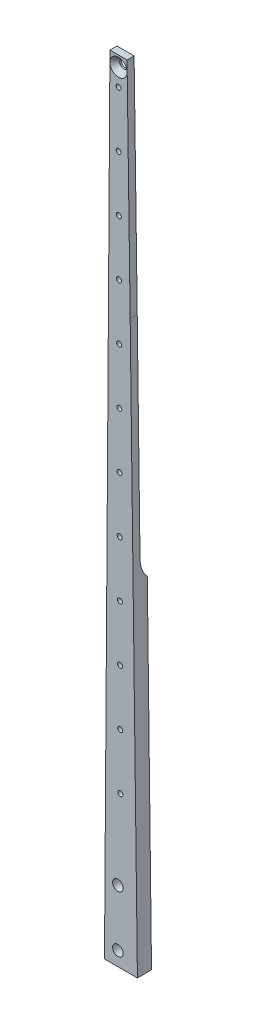
ISO-10303-21;
HEADER;
FILE_DESCRIPTION(('STEP AP214'),'2;1');
FILE_NAME('part.step','',(''),(''),'','','');
FILE_SCHEMA(('AUTOMOTIVE_DESIGN { 1 0 10303 214 1 1 1 1 }'));
ENDSEC;
DATA;
#1=APPLICATION_CONTEXT('core data for automotive mechanical design processes');
#2=APPLICATION_PROTOCOL_DEFINITION('international standard','automotive_design',2000,#1);
#3=PRODUCT_CONTEXT('',#1,'mechanical');
#4=PRODUCT('Part','Part','',(#3));
#5=PRODUCT_RELATED_PRODUCT_CATEGORY('part','',(#4));
#6=PRODUCT_DEFINITION_FORMATION('','',#4);
#7=PRODUCT_DEFINITION_CONTEXT('part definition',#1,'design');
#8=PRODUCT_DEFINITION('design','',#6,#7);
#9=PRODUCT_DEFINITION_SHAPE('','',#8);
#10=(LENGTH_UNIT() NAMED_UNIT(*) SI_UNIT(.MILLI.,.METRE.));
#11=(NAMED_UNIT(*) PLANE_ANGLE_UNIT() SI_UNIT($,.RADIAN.));
#12=(NAMED_UNIT(*) SI_UNIT($,.STERADIAN.) SOLID_ANGLE_UNIT());
#13=UNCERTAINTY_MEASURE_WITH_UNIT(LENGTH_MEASURE(1.E-05),#10,'distance_accuracy_value','');
#14=(GEOMETRIC_REPRESENTATION_CONTEXT(3) GLOBAL_UNCERTAINTY_ASSIGNED_CONTEXT((#13)) GLOBAL_UNIT_ASSIGNED_CONTEXT((#10,
#11,#12)) REPRESENTATION_CONTEXT('',''));
#15=CARTESIAN_POINT('',(0.,0.,0.));
#16=DIRECTION('',(0.,0.,1.));
#17=DIRECTION('',(1.,0.,0.));
#18=AXIS2_PLACEMENT_3D('',#15,#16,#17);
#19=CARTESIAN_POINT('',(9.32217062218469,164.894478893375,6.35));
#20=DIRECTION('',(0.,0.,-1.));
#21=DIRECTION('',(-1.,0.,0.));
#22=AXIS2_PLACEMENT_3D('',#19,#20,#21);
#23=PLANE('',#22);
#24=CARTESIAN_POINT('',(2.98775026478225,162.497082585507,6.35));
#25=DIRECTION('',(0.,0.,1.));
#26=DIRECTION('',(1.,0.,0.));
#27=AXIS2_PLACEMENT_3D('',#24,#25,#26);
#28=CIRCLE('',#27,1.13029999999999);
#29=CARTESIAN_POINT('',(4.11805026478223,162.497082585507,6.35));
#30=VERTEX_POINT('',#29);
#31=EDGE_CURVE('E236',#30,#30,#28,.T.);
#32=ORIENTED_EDGE('',*,*,#31,.F.);
#33=EDGE_LOOP('',(#32));
#34=FACE_BOUND('',#33,.T.);
#35=CARTESIAN_POINT('',(2.83264579083282,212.49684201095,6.35));
#36=DIRECTION('',(0.,0.,1.));
#37=DIRECTION('',(1.,0.,0.));
#38=AXIS2_PLACEMENT_3D('',#35,#36,#37);
#39=CIRCLE('',#38,1.13029999999999);
#40=CARTESIAN_POINT('',(3.96294579083281,212.49684201095,6.35));
#41=VERTEX_POINT('',#40);
#42=EDGE_CURVE('E240',#41,#41,#39,.T.);
#43=ORIENTED_EDGE('',*,*,#42,.F.);
#44=EDGE_LOOP('',(#43));
#45=FACE_BOUND('',#44,.T.);
#46=CARTESIAN_POINT('',(2.75509355385811,237.496721723671,6.35));
#47=DIRECTION('',(0.,0.,1.));
#48=DIRECTION('',(1.,0.,0.));
#49=AXIS2_PLACEMENT_3D('',#46,#47,#48);
#50=CIRCLE('',#49,1.13029999999999);
#51=CARTESIAN_POINT('',(3.8853935538581,237.496721723671,6.35));
#52=VERTEX_POINT('',#51);
#53=EDGE_CURVE('E244',#52,#52,#50,.T.);
#54=ORIENTED_EDGE('',*,*,#53,.F.);
#55=EDGE_LOOP('',(#54));
#56=FACE_BOUND('',#55,.T.);
#57=CARTESIAN_POINT('',(2.36733236898454,362.496120287279,6.35));
#58=DIRECTION('',(0.,0.,1.));
#59=DIRECTION('',(1.,0.,0.));
#60=AXIS2_PLACEMENT_3D('',#57,#58,#59);
#61=CIRCLE('',#60,1.13029999999999);
#62=CARTESIAN_POINT('',(3.49763236898453,362.496120287279,6.35));
#63=VERTEX_POINT('',#62);
#64=EDGE_CURVE('E248',#63,#63,#61,.T.);
#65=ORIENTED_EDGE('',*,*,#64,.F.);
#66=EDGE_LOOP('',(#65));
#67=FACE_BOUND('',#66,.T.);
#68=CARTESIAN_POINT('',(2.28978013200983,387.496,6.35));
#69=DIRECTION('',(0.,0.,1.));
#70=DIRECTION('',(1.,0.,0.));
#71=AXIS2_PLACEMENT_3D('',#68,#69,#70);
#72=CIRCLE('',#71,1.13029999999999);
#73=CARTESIAN_POINT('',(3.42008013200982,387.496,6.35));
#74=VERTEX_POINT('',#73);
#75=EDGE_CURVE('E252',#74,#74,#72,.T.);
#76=ORIENTED_EDGE('',*,*,#75,.F.);
#77=EDGE_LOOP('',(#76));
#78=FACE_BOUND('',#77,.T.);
#79=CARTESIAN_POINT('',(2.03199999999999,76.2,6.35));
#80=DIRECTION('',(0.,0.,1.));
#81=DIRECTION('',(1.,0.,0.));
#82=AXIS2_PLACEMENT_3D('',#79,#80,#81);
#83=CIRCLE('',#82,2.38125);
#84=CARTESIAN_POINT('',(4.41324999999999,76.2,6.35));
#85=VERTEX_POINT('',#84);
#86=EDGE_CURVE('E256',#85,#85,#83,.T.);
#87=ORIENTED_EDGE('',*,*,#86,.F.);
#88=EDGE_LOOP('',(#87));
#89=FACE_BOUND('',#88,.T.);
#90=CARTESIAN_POINT('',(2.03199999999999,50.8,6.35));
#91=DIRECTION('',(0.,0.,1.));
#92=DIRECTION('',(1.,0.,0.));
#93=AXIS2_PLACEMENT_3D('',#90,#91,#92);
#94=CIRCLE('',#93,2.38125);
#95=CARTESIAN_POINT('',(4.41324999999999,50.8,6.35));
#96=VERTEX_POINT('',#95);
#97=EDGE_CURVE('E260',#96,#96,#94,.T.);
#98=ORIENTED_EDGE('',*,*,#97,.F.);
#99=EDGE_LOOP('',(#98));
#100=FACE_BOUND('',#99,.T.);
#101=CARTESIAN_POINT('',(2.28978013200885,395.2335,6.35));
#102=DIRECTION('',(0.,0.,1.));
#103=DIRECTION('',(1.,0.,0.));
#104=AXIS2_PLACEMENT_3D('',#101,#102,#103);
#105=CIRCLE('',#104,3.8989);
#106=CARTESIAN_POINT('',(-1.59728519476518,394.929947112695,6.35));
#107=VERTEX_POINT('',#106);
#108=CARTESIAN_POINT('',(-1.59303981376289,395.587237867228,6.35));
#109=VERTEX_POINT('',#108);
#110=EDGE_CURVE('E264',#107,#109,#105,.T.);
#111=ORIENTED_EDGE('',*,*,#110,.F.);
#112=CARTESIAN_POINT('',(-1.56462820167378,399.996,6.35));
#113=CARTESIAN_POINT('',(-1.6371747875035,388.716209790455,6.35));
#114=CARTESIAN_POINT('',(-1.71083889844835,377.436426733535,6.35));
#115=CARTESIAN_POINT('',(-1.93103005471591,344.124623437937,6.35));
#116=CARTESIAN_POINT('',(-2.08019527510727,322.071076557673,6.35));
#117=CARTESIAN_POINT('',(-2.23129548472252,300.017543046815,6.35));
#118=CARTESIAN_POINT('',(-2.23144308921492,299.996,6.35));
#119=B_SPLINE_CURVE_WITH_KNOTS('',3,(#112,#113,#114,#115,#116,#117,#118),.UNSPECIFIED.,.F.,.F.,
(4,2,1,4),(0.,0.338393179002608,0.999353707800301,1.),.UNSPECIFIED.);
#120=CARTESIAN_POINT('',(-2.23144308921492,299.996,6.35));
#121=VERTEX_POINT('',#120);
#122=EDGE_CURVE('E402',#107,#121,#119,.T.);
#123=ORIENTED_EDGE('',*,*,#122,.T.);
#124=CARTESIAN_POINT('',(-2.23144308921492,299.996,6.35));
#125=CARTESIAN_POINT('',(-2.23491000056348,299.490015836162,6.35));
#126=CARTESIAN_POINT('',(-2.39299843190897,276.424514525694,6.35));
#127=CARTESIAN_POINT('',(-2.55314908860154,253.359027395926,6.35));
#128=CARTESIAN_POINT('',(-2.86833907382584,208.240034357139,6.35));
#129=CARTESIAN_POINT('',(-3.0269190975399,185.680544745873,6.35));
#130=CARTESIAN_POINT('',(-3.34635833842684,140.300046379748,6.35));
#131=CARTESIAN_POINT('',(-3.65559703839005,96.4206918557666,6.35));
#132=CARTESIAN_POINT('',(-3.9627245604797,52.541322480231,6.35));
#133=CARTESIAN_POINT('',(-4.10919890948207,31.4829633980397,6.35));
#134=B_SPLINE_CURVE_WITH_KNOTS('',3,(#124,#125,#126,#127,#128,#129,#130,#131,#132,#133),
.UNSPECIFIED.,.F.,.F.,(4,1,2,2,1,4),(0.,0.00565317431811734,0.257702337274979,0.509751499418767,
0.764722557038449,1.),.UNSPECIFIED.);
#135=CARTESIAN_POINT('',(-4.0188922710135,44.45,6.35));
#136=VERTEX_POINT('',#135);
#137=EDGE_CURVE('E158',#121,#136,#134,.T.);
#138=ORIENTED_EDGE('',*,*,#137,.T.);
#139=DIRECTION('',(-1.,0.,0.));
#140=VECTOR('',#139,1.);
#141=CARTESIAN_POINT('',(12.7,44.45,6.35));
#142=LINE('',#141,#140);
#143=CARTESIAN_POINT('',(10.804334160404,44.45,6.35));
#144=VERTEX_POINT('',#143);
#145=EDGE_CURVE('E369',#144,#136,#142,.T.);
#146=ORIENTED_EDGE('',*,*,#145,.F.);
#147=CARTESIAN_POINT('',(10.978749619499,29.7914342855853,6.35));
#148=CARTESIAN_POINT('',(9.91085869355929,119.860572239238,6.35));
#149=CARTESIAN_POINT('',(8.77329258674864,209.928893381234,6.35));
#150=CARTESIAN_POINT('',(7.54616151705476,299.996,6.35));
#151=B_SPLINE_CURVE_WITH_KNOTS('',3,(#147,#148,#149,#150),.UNSPECIFIED.,.F.,.F.,(4,4),(0.,1.),.UNSPECIFIED.);
#152=CARTESIAN_POINT('',(7.54616151705475,299.996,6.35));
#153=VERTEX_POINT('',#152);
#154=EDGE_CURVE('E181',#144,#153,#151,.T.);
#155=ORIENTED_EDGE('',*,*,#154,.T.);
#156=CARTESIAN_POINT('',(7.54616151705475,299.996,6.35));
#157=CARTESIAN_POINT('',(7.09200287333961,333.329517912994,6.35));
#158=CARTESIAN_POINT('',(6.6238073662164,366.662839032945,6.35));
#159=CARTESIAN_POINT('',(6.14418846569149,399.996,6.35));
#160=B_SPLINE_CURVE_WITH_KNOTS('',3,(#156,#157,#158,#159),.UNSPECIFIED.,.F.,.F.,(4,4),(0.,1.),.UNSPECIFIED.);
#161=CARTESIAN_POINT('',(6.14418846569149,399.996,6.35));
#162=VERTEX_POINT('',#161);
#163=EDGE_CURVE('E379',#153,#162,#160,.T.);
#164=ORIENTED_EDGE('',*,*,#163,.T.);
#165=DIRECTION('',(-1.,0.,0.));
#166=VECTOR('',#165,1.);
#167=CARTESIAN_POINT('',(6.14418846569149,399.996,6.35));
#168=LINE('',#167,#166);
#169=CARTESIAN_POINT('',(-1.56462820167378,399.996,6.35));
#170=VERTEX_POINT('',#169);
#171=EDGE_CURVE('E403',#162,#170,#168,.T.);
#172=ORIENTED_EDGE('',*,*,#171,.T.);
#173=EDGE_CURVE('E164',#170,#109,#119,.T.);
#174=ORIENTED_EDGE('',*,*,#173,.T.);
#175=EDGE_LOOP('',(#111,#123,#138,#146,#155,#164,#172,#174));
#176=FACE_BOUND('',#175,.T.);
#177=CARTESIAN_POINT('',(2.44488460595926,337.496240574557,6.35));
#178=DIRECTION('',(0.,0.,1.));
#179=DIRECTION('',(1.,0.,0.));
#180=AXIS2_PLACEMENT_3D('',#177,#178,#179);
#181=CIRCLE('',#180,1.13029999999999);
#182=CARTESIAN_POINT('',(3.57518460595924,337.496240574557,6.35));
#183=VERTEX_POINT('',#182);
#184=EDGE_CURVE('E269',#183,#183,#181,.T.);
#185=ORIENTED_EDGE('',*,*,#184,.F.);
#186=EDGE_LOOP('',(#185));
#187=FACE_BOUND('',#186,.T.);
#188=CARTESIAN_POINT('',(2.52243684293397,312.496360861836,6.35));
#189=DIRECTION('',(0.,0.,1.));
#190=DIRECTION('',(1.,0.,0.));
#191=AXIS2_PLACEMENT_3D('',#188,#189,#190);
#192=CIRCLE('',#191,1.13029999999999);
#193=CARTESIAN_POINT('',(3.65273684293396,312.496360861836,6.35));
#194=VERTEX_POINT('',#193);
#195=EDGE_CURVE('E273',#194,#194,#192,.T.);
#196=ORIENTED_EDGE('',*,*,#195,.F.);
#197=EDGE_LOOP('',(#196));
#198=FACE_BOUND('',#197,.T.);
#199=CARTESIAN_POINT('',(2.59998907990868,287.496481149114,6.35));
#200=DIRECTION('',(0.,0.,1.));
#201=DIRECTION('',(1.,0.,0.));
#202=AXIS2_PLACEMENT_3D('',#199,#200,#201);
#203=CIRCLE('',#202,1.13029999999999);
#204=CARTESIAN_POINT('',(3.73028907990867,287.496481149114,6.35));
#205=VERTEX_POINT('',#204);
#206=EDGE_CURVE('E277',#205,#205,#203,.T.);
#207=ORIENTED_EDGE('',*,*,#206,.F.);
#208=EDGE_LOOP('',(#207));
#209=FACE_BOUND('',#208,.T.);
#210=CARTESIAN_POINT('',(2.6775413168834,262.496601436393,6.35));
#211=DIRECTION('',(0.,0.,1.));
#212=DIRECTION('',(1.,0.,0.));
#213=AXIS2_PLACEMENT_3D('',#210,#211,#212);
#214=CIRCLE('',#213,1.13029999999999);
#215=CARTESIAN_POINT('',(3.80784131688338,262.496601436393,6.35));
#216=VERTEX_POINT('',#215);
#217=EDGE_CURVE('E281',#216,#216,#214,.T.);
#218=ORIENTED_EDGE('',*,*,#217,.F.);
#219=EDGE_LOOP('',(#218));
#220=FACE_BOUND('',#219,.T.);
#221=CARTESIAN_POINT('',(2.91019802780753,187.496962298229,6.35));
#222=DIRECTION('',(0.,0.,1.));
#223=DIRECTION('',(1.,0.,0.));
#224=AXIS2_PLACEMENT_3D('',#221,#222,#223);
#225=CIRCLE('',#224,1.13029999999999);
#226=CARTESIAN_POINT('',(4.04049802780752,187.496962298229,6.35));
#227=VERTEX_POINT('',#226);
#228=EDGE_CURVE('E285',#227,#227,#225,.T.);
#229=ORIENTED_EDGE('',*,*,#228,.F.);
#230=EDGE_LOOP('',(#229));
#231=FACE_BOUND('',#230,.T.);
#232=CARTESIAN_POINT('',(3.06530250175696,137.497202872786,6.35));
#233=DIRECTION('',(0.,0.,1.));
#234=DIRECTION('',(1.,0.,0.));
#235=AXIS2_PLACEMENT_3D('',#232,#233,#234);
#236=CIRCLE('',#235,1.13029999999999);
#237=CARTESIAN_POINT('',(4.19560250175695,137.497202872786,6.35));
#238=VERTEX_POINT('',#237);
#239=EDGE_CURVE('E289',#238,#238,#236,.T.);
#240=ORIENTED_EDGE('',*,*,#239,.F.);
#241=EDGE_LOOP('',(#240));
#242=FACE_BOUND('',#241,.T.);
#243=CARTESIAN_POINT('',(3.14285473873167,112.497323160064,6.35));
#244=DIRECTION('',(0.,0.,1.));
#245=DIRECTION('',(1.,0.,0.));
#246=AXIS2_PLACEMENT_3D('',#243,#244,#245);
#247=CIRCLE('',#246,1.13029999999999);
#248=CARTESIAN_POINT('',(4.27315473873166,112.497323160064,6.35));
#249=VERTEX_POINT('',#248);
#250=EDGE_CURVE('E292',#249,#249,#247,.T.);
#251=ORIENTED_EDGE('',*,*,#250,.F.);
#252=EDGE_LOOP('',(#251));
#253=FACE_BOUND('',#252,.T.);
#254=ADVANCED_FACE('F37',(#34,#45,#56,#67,#78,#89,#100,#176,#187,#198,#209,#220,#231,#242,#253),
#23,.F.);
#255=DIRECTION('',(0.,0.,-1.));
#256=VECTOR('',#255,1.);
#257=SURFACE_OF_LINEAR_EXTRUSION('',#160,#256);
#258=CARTESIAN_POINT('',(7.54616151705475,299.996,3.175));
#259=CARTESIAN_POINT('',(7.09200287333961,333.329517912994,3.175));
#260=CARTESIAN_POINT('',(6.6238073662164,366.662839032945,3.175));
#261=CARTESIAN_POINT('',(6.14418846569149,399.996,3.175));
#262=B_SPLINE_CURVE_WITH_KNOTS('',3,(#258,#259,#260,#261),.UNSPECIFIED.,.F.,.F.,(4,4),(0.,1.),.UNSPECIFIED.);
#263=CARTESIAN_POINT('',(6.14418846569149,399.996,3.175));
#264=VERTEX_POINT('',#263);
#265=CARTESIAN_POINT('',(7.54616151705475,299.996,3.175));
#266=VERTEX_POINT('',#265);
#267=EDGE_CURVE('E340',#264,#266,#262,.F.);
#268=ORIENTED_EDGE('',*,*,#267,.F.);
#269=DIRECTION('',(0.,0.,-1.));
#270=VECTOR('',#269,1.);
#271=CARTESIAN_POINT('',(6.14418846569149,399.996,6.35));
#272=LINE('',#271,#270);
#273=EDGE_CURVE('E190',#162,#264,#272,.T.);
#274=ORIENTED_EDGE('',*,*,#273,.F.);
#275=ORIENTED_EDGE('',*,*,#163,.F.);
#276=DIRECTION('',(0.,0.,-1.));
#277=VECTOR('',#276,1.);
#278=CARTESIAN_POINT('',(7.54616151705475,299.996,6.35));
#279=LINE('',#278,#277);
#280=EDGE_CURVE('E193',#153,#266,#279,.T.);
#281=ORIENTED_EDGE('',*,*,#280,.T.);
#282=EDGE_LOOP('',(#268,#274,#275,#281));
#283=FACE_BOUND('',#282,.T.);
#284=ADVANCED_FACE('F225',(#283),#257,.F.);
#285=CARTESIAN_POINT('',(6.14418846569149,399.996,6.35));
#286=DIRECTION('',(0.,-1.,0.));
#287=DIRECTION('',(1.,0.,0.));
#288=AXIS2_PLACEMENT_3D('',#285,#286,#287);
#289=PLANE('',#288);
#290=DIRECTION('',(1.,0.,0.));
#291=VECTOR('',#290,1.);
#292=CARTESIAN_POINT('',(-13.374739093365,399.996,3.175));
#293=LINE('',#292,#291);
#294=CARTESIAN_POINT('',(-1.56462820167378,399.996,3.175));
#295=VERTEX_POINT('',#294);
#296=EDGE_CURVE('E117',#295,#264,#293,.T.);
#297=ORIENTED_EDGE('',*,*,#296,.F.);
#298=DIRECTION('',(0.,0.,-1.));
#299=VECTOR('',#298,1.);
#300=CARTESIAN_POINT('',(-1.56462820167378,399.996,6.35));
#301=LINE('',#300,#299);
#302=EDGE_CURVE('E187',#170,#295,#301,.T.);
#303=ORIENTED_EDGE('',*,*,#302,.F.);
#304=ORIENTED_EDGE('',*,*,#171,.F.);
#305=ORIENTED_EDGE('',*,*,#273,.T.);
#306=EDGE_LOOP('',(#297,#303,#304,#305));
#307=FACE_BOUND('',#306,.T.);
#308=ADVANCED_FACE('F230',(#307),#289,.F.);
#309=DIRECTION('',(0.,0.,-1.));
#310=VECTOR('',#309,1.);
#311=SURFACE_OF_LINEAR_EXTRUSION('',#119,#310);
#312=CARTESIAN_POINT('',(-1.56462820167378,399.996,3.175));
#313=CARTESIAN_POINT('',(-1.6371747875035,388.716209790455,3.175));
#314=CARTESIAN_POINT('',(-1.71083889844835,377.436426733535,3.175));
#315=CARTESIAN_POINT('',(-1.93103005471591,344.124623437937,3.175));
#316=CARTESIAN_POINT('',(-2.08019527510727,322.071076557673,3.175));
#317=CARTESIAN_POINT('',(-2.23129548472252,300.017543046815,3.175));
#318=CARTESIAN_POINT('',(-2.23144308921492,299.996,3.175));
#319=B_SPLINE_CURVE_WITH_KNOTS('',3,(#312,#313,#314,#315,#316,#317,#318),.UNSPECIFIED.,.F.,.F.,
(4,2,1,4),(0.,0.338393179002608,0.999353707800301,1.),.UNSPECIFIED.);
#320=CARTESIAN_POINT('',(-2.23144308921492,299.996,3.175));
#321=VERTEX_POINT('',#320);
#322=EDGE_CURVE('E329',#321,#295,#319,.F.);
#323=ORIENTED_EDGE('',*,*,#322,.F.);
#324=DIRECTION('',(0.,0.,-1.));
#325=VECTOR('',#324,1.);
#326=CARTESIAN_POINT('',(-2.23144308921492,299.996,6.35));
#327=LINE('',#326,#325);
#328=EDGE_CURVE('E163',#121,#321,#327,.T.);
#329=ORIENTED_EDGE('',*,*,#328,.F.);
#330=ORIENTED_EDGE('',*,*,#122,.F.);
#331=CARTESIAN_POINT('',(-1.59728519476517,394.929947112695,6.35));
#332=CARTESIAN_POINT('',(-1.59657742632141,395.03949557046,6.3393578368422));
#333=CARTESIAN_POINT('',(-1.59586976034934,395.149044028887,6.33403675526322));
#334=CARTESIAN_POINT('',(-1.59445463334857,395.368140947065,6.33403675526292));
#335=CARTESIAN_POINT('',(-1.59374717231988,395.477689406816,6.3393578368416));
#336=CARTESIAN_POINT('',(-1.59303981376289,395.587237867228,6.3499999999991));
#337=B_SPLINE_CURVE_WITH_KNOTS('',3,(#331,#332,#333,#334,#335,#336),.UNSPECIFIED.,.F.,.F.,(4,2,
4),(0.,0.329039686050416,0.658079372100812),.UNSPECIFIED.);
#338=EDGE_CURVE('E128',#107,#109,#337,.T.);
#339=ORIENTED_EDGE('',*,*,#338,.T.);
#340=ORIENTED_EDGE('',*,*,#173,.F.);
#341=ORIENTED_EDGE('',*,*,#302,.T.);
#342=EDGE_LOOP('',(#323,#329,#330,#339,#340,#341));
#343=FACE_BOUND('',#342,.T.);
#344=ADVANCED_FACE('F154',(#343),#311,.F.);
#345=CARTESIAN_POINT('',(2.28978013200885,395.2335,6.35));
#346=DIRECTION('',(0.,0.,1.));
#347=DIRECTION('',(1.,0.,0.));
#348=AXIS2_PLACEMENT_3D('',#345,#346,#347);
#349=CYLINDRICAL_SURFACE('',#348,1.82879999999999);
#350=CARTESIAN_POINT('',(2.28978013200885,395.2335,3.96862236021177));
#351=DIRECTION('',(0.,0.,1.));
#352=DIRECTION('',(1.,0.,0.));
#353=AXIS2_PLACEMENT_3D('',#350,#351,#352);
#354=CIRCLE('',#353,1.82879999999999);
#355=CARTESIAN_POINT('',(4.11858013200884,395.2335,3.96862236021177));
#356=VERTEX_POINT('',#355);
#357=EDGE_CURVE('E358',#356,#356,#354,.T.);
#358=ORIENTED_EDGE('',*,*,#357,.T.);
#359=EDGE_LOOP('',(#358));
#360=FACE_BOUND('',#359,.T.);
#361=CARTESIAN_POINT('',(2.28978013200885,395.2335,3.175));
#362=DIRECTION('',(0.,0.,-1.));
#363=DIRECTION('',(-1.,0.,0.));
#364=AXIS2_PLACEMENT_3D('',#361,#362,#363);
#365=CIRCLE('',#364,1.82879999999999);
#366=CARTESIAN_POINT('',(0.460980132008861,395.2335,3.175));
#367=VERTEX_POINT('',#366);
#368=EDGE_CURVE('E135',#367,#367,#365,.F.);
#369=ORIENTED_EDGE('',*,*,#368,.F.);
#370=EDGE_LOOP('',(#369));
#371=FACE_BOUND('',#370,.T.);
#372=ADVANCED_FACE('F210',(#360,#371),#349,.F.);
#373=DIRECTION('',(0.,0.,-1.));
#374=VECTOR('',#373,1.);
#375=SURFACE_OF_LINEAR_EXTRUSION('',#151,#374);
#376=CARTESIAN_POINT('',(10.978749619499,29.7914342855853,0.));
#377=CARTESIAN_POINT('',(9.91085869355929,119.860572239238,0.));
#378=CARTESIAN_POINT('',(8.77329258674864,209.928893381234,0.));
#379=CARTESIAN_POINT('',(7.54616151705476,299.996,0.));
#380=B_SPLINE_CURVE_WITH_KNOTS('',3,(#376,#377,#378,#379),.UNSPECIFIED.,.F.,.F.,(4,4),(0.,1.),.UNSPECIFIED.);
#381=CARTESIAN_POINT('',(10.804334160404,44.45,0.));
#382=VERTEX_POINT('',#381);
#383=CARTESIAN_POINT('',(8.91412882013365,196.796,0.));
#384=VERTEX_POINT('',#383);
#385=EDGE_CURVE('E115',#382,#384,#380,.T.);
#386=ORIENTED_EDGE('',*,*,#385,.T.);
#387=CARTESIAN_POINT('',(8.91412882013365,196.796,0.));
#388=CARTESIAN_POINT('',(8.911828108261,196.974389819341,0.157335072633163));
#389=CARTESIAN_POINT('',(8.90946995587916,197.157208325913,0.309646369273341));
#390=CARTESIAN_POINT('',(8.90464639388709,197.531104583722,0.603766508876963));
#391=CARTESIAN_POINT('',(8.90218098467464,197.722182304328,0.745575390785927));
#392=CARTESIAN_POINT('',(8.89715049973853,198.112001424151,1.01823783449251));
#393=CARTESIAN_POINT('',(8.89458542338508,198.310742871793,1.14909132704896));
#394=CARTESIAN_POINT('',(8.88935941226531,198.715587456393,1.39963437007923));
#395=CARTESIAN_POINT('',(8.88669832837307,198.921702041222,1.51930541647878));
#396=CARTESIAN_POINT('',(8.8812926148244,199.340332392736,1.74686136706235));
#397=CARTESIAN_POINT('',(8.87854798783908,199.552847954761,1.85474664756565));
#398=CARTESIAN_POINT('',(8.87298408626675,199.983585208736,2.05838381582487));
#399=CARTESIAN_POINT('',(8.87016481544353,200.201806612972,2.15413631395131));
#400=CARTESIAN_POINT('',(8.86303123314621,200.753873861041,2.37806534004997));
#401=CARTESIAN_POINT('',(8.85867511881369,201.09090686319,2.49847274724908));
#402=CARTESIAN_POINT('',(8.84984454391639,201.773943309004,2.71042612609173));
#403=CARTESIAN_POINT('',(8.84537006921629,202.119947824002,2.80196863349355));
#404=CARTESIAN_POINT('',(8.83634660548468,202.817525384162,2.95533787687691));
#405=CARTESIAN_POINT('',(8.83179784078929,203.169081585676,3.01724136010271));
#406=CARTESIAN_POINT('',(8.82264852492716,203.875998324093,3.11121449868237));
#407=CARTESIAN_POINT('',(8.81804800815526,204.231356327394,3.14330290613172));
#408=CARTESIAN_POINT('',(8.8121246194314,204.688768537435,3.16526342147526));
#409=CARTESIAN_POINT('',(8.81081000498075,204.790276763341,3.16891592709835));
#410=CARTESIAN_POINT('',(8.80818082216675,204.993273452835,3.17378292151737));
#411=CARTESIAN_POINT('',(8.80686625454704,205.094761871478,3.1749992850327));
#412=CARTESIAN_POINT('',(8.80555145099561,205.19626041263,3.175));
#413=B_SPLINE_CURVE_WITH_KNOTS('',3,(#387,#388,#389,#390,#391,#392,#393,#394,#395,#396,#397,
#398,#399,#400,#401,#402,#403,#404,#405,#406,#407,#408,#409,#410,#411,#412),.UNSPECIFIED.,.F.,
.F.,(4,2,2,2,2,2,2,2,2,2,2,2,4),(0.,0.713517269334272,1.42703189263964,2.14055102521979,
2.85523068123177,3.56988751086187,4.2845083735726,5.35692452345507,6.42946933118895,
7.49922166845128,8.56830073210423,8.87302895639274,9.17752258855459),.UNSPECIFIED.);
#414=CARTESIAN_POINT('',(8.80555145099561,205.19626041263,3.175));
#415=VERTEX_POINT('',#414);
#416=EDGE_CURVE('E11',#384,#415,#413,.T.);
#417=ORIENTED_EDGE('',*,*,#416,.T.);
#418=CARTESIAN_POINT('',(10.978749619499,29.7914342855853,3.175));
#419=CARTESIAN_POINT('',(9.91085869355929,119.860572239238,3.175));
#420=CARTESIAN_POINT('',(8.77329258674864,209.928893381234,3.175));
#421=CARTESIAN_POINT('',(7.54616151705476,299.996,3.175));
#422=B_SPLINE_CURVE_WITH_KNOTS('',3,(#418,#419,#420,#421),.UNSPECIFIED.,.F.,.F.,(4,4),(0.,1.),.UNSPECIFIED.);
#423=EDGE_CURVE('E347',#266,#415,#422,.F.);
#424=ORIENTED_EDGE('',*,*,#423,.F.);
#425=ORIENTED_EDGE('',*,*,#280,.F.);
#426=ORIENTED_EDGE('',*,*,#154,.F.);
#427=DIRECTION('',(0.,0.,-1.));
#428=VECTOR('',#427,1.);
#429=CARTESIAN_POINT('',(10.804334160404,44.45,6.35));
#430=LINE('',#429,#428);
#431=EDGE_CURVE('E123',#382,#144,#430,.F.);
#432=ORIENTED_EDGE('',*,*,#431,.F.);
#433=EDGE_LOOP('',(#386,#417,#424,#425,#426,#432));
#434=FACE_BOUND('',#433,.T.);
#435=ADVANCED_FACE('F121',(#434),#375,.F.);
#436=DIRECTION('',(0.,0.,-1.));
#437=VECTOR('',#436,1.);
#438=SURFACE_OF_LINEAR_EXTRUSION('',#134,#437);
#439=CARTESIAN_POINT('',(-2.23144308921492,299.996,3.175));
#440=CARTESIAN_POINT('',(-2.23491000056348,299.490015836162,3.175));
#441=CARTESIAN_POINT('',(-2.39299843190897,276.424514525694,3.175));
#442=CARTESIAN_POINT('',(-2.55314908860154,253.359027395926,3.175));
#443=CARTESIAN_POINT('',(-2.86833907382584,208.240034357139,3.175));
#444=CARTESIAN_POINT('',(-3.0269190975399,185.680544745873,3.175));
#445=CARTESIAN_POINT('',(-3.34635833842684,140.300046379748,3.175));
#446=CARTESIAN_POINT('',(-3.65559703839005,96.4206918557666,3.175));
#447=CARTESIAN_POINT('',(-3.9627245604797,52.541322480231,3.175));
#448=CARTESIAN_POINT('',(-4.10919890948207,31.4829633980397,3.175));
#449=B_SPLINE_CURVE_WITH_KNOTS('',3,(#439,#440,#441,#442,#443,#444,#445,#446,#447,#448),
.UNSPECIFIED.,.F.,.F.,(4,1,2,2,1,4),(0.,0.00565317431811734,0.257702337274979,0.509751499418767,
0.764722557038449,1.),.UNSPECIFIED.);
#450=CARTESIAN_POINT('',(-2.88998359130755,205.19626041263,3.175));
#451=VERTEX_POINT('',#450);
#452=EDGE_CURVE('E333',#451,#321,#449,.F.);
#453=ORIENTED_EDGE('',*,*,#452,.F.);
#454=CARTESIAN_POINT('',(-2.88998359130755,205.19626041263,3.175));
#455=CARTESIAN_POINT('',(-2.89165183874844,204.958412578871,3.17500752847791));
#456=CARTESIAN_POINT('',(-2.89332015830395,204.720565578128,3.16831859484388));
#457=CARTESIAN_POINT('',(-2.89665168191138,204.245622534799,3.14160204766512));
#458=CARTESIAN_POINT('',(-2.89831488598,204.008526489763,3.12157447769535));
#459=CARTESIAN_POINT('',(-2.90163094053523,203.53583156292,3.06823472961054));
#460=CARTESIAN_POINT('',(-2.90328379095505,203.300232690772,3.03492246587616));
#461=CARTESIAN_POINT('',(-2.90657658002036,202.830896009602,2.9550563141124));
#462=CARTESIAN_POINT('',(-2.90821649324717,202.59716185735,2.90848094435861));
#463=CARTESIAN_POINT('',(-2.91147545608705,202.132687140085,2.80225708524711));
#464=CARTESIAN_POINT('',(-2.91309450636706,201.901946479374,2.7426090148972));
#465=CARTESIAN_POINT('',(-2.91630646610926,201.444209730419,2.61043886245811));
#466=CARTESIAN_POINT('',(-2.91789937688371,201.217213454194,2.53791742881419));
#467=CARTESIAN_POINT('',(-2.92184438942098,200.655055825937,2.34071612801329));
#468=CARTESIAN_POINT('',(-2.92417728985362,200.322642124007,2.20810131874011));
#469=CARTESIAN_POINT('',(-2.92875661094883,199.670174468599,1.91529187002999));
#470=CARTESIAN_POINT('',(-2.93100302120644,199.35012200219,1.75509392488738));
#471=CARTESIAN_POINT('',(-2.93538744575451,198.725494021564,1.4087273788733));
#472=CARTESIAN_POINT('',(-2.93752572711715,198.420880369643,1.22262750338411));
#473=CARTESIAN_POINT('',(-2.94168401590971,197.8285314774,0.825535178370847));
#474=CARTESIAN_POINT('',(-2.94370409693932,197.540785733745,0.614558471071702));
#475=CARTESIAN_POINT('',(-2.94621477888913,197.183173808138,0.328465522106508));
#476=CARTESIAN_POINT('',(-2.9467664063294,197.104603175068,0.264045584764277));
#477=CARTESIAN_POINT('',(-2.9478582435841,196.949090190476,0.133389137092061));
#478=CARTESIAN_POINT('',(-2.94839846186122,196.872146632023,0.0671540633876382));
#479=CARTESIAN_POINT('',(-2.94893309170267,196.796,0.));
#480=B_SPLINE_CURVE_WITH_KNOTS('',3,(#454,#455,#456,#457,#458,#459,#460,#461,#462,#463,#464,
#465,#466,#467,#468,#469,#470,#471,#472,#473,#474,#475,#476,#477,#478,#479),.UNSPECIFIED.,.F.,
.F.,(4,2,2,2,2,2,2,2,2,2,2,2,4),(0.,0.713465778958233,1.42692922716151,2.14039727368372,
2.85502753342702,3.56963489110384,4.28420626344326,5.35655048263683,6.42902330667366,
7.49870295048052,8.56770929039243,8.87250523323418,9.17706653573727),.UNSPECIFIED.);
#481=CARTESIAN_POINT('',(-2.94893309170267,196.796,0.));
#482=VERTEX_POINT('',#481);
#483=EDGE_CURVE('E47',#451,#482,#480,.T.);
#484=ORIENTED_EDGE('',*,*,#483,.T.);
#485=CARTESIAN_POINT('',(-2.23144308921492,299.996,0.));
#486=CARTESIAN_POINT('',(-2.23491000056348,299.490015836162,0.));
#487=CARTESIAN_POINT('',(-2.39299843190897,276.424514525694,0.));
#488=CARTESIAN_POINT('',(-2.55314908860154,253.359027395926,0.));
#489=CARTESIAN_POINT('',(-2.86833907382584,208.240034357139,0.));
#490=CARTESIAN_POINT('',(-3.0269190975399,185.680544745873,0.));
#491=CARTESIAN_POINT('',(-3.34635833842684,140.300046379748,0.));
#492=CARTESIAN_POINT('',(-3.65559703839005,96.4206918557666,0.));
#493=CARTESIAN_POINT('',(-3.9627245604797,52.541322480231,0.));
#494=CARTESIAN_POINT('',(-4.10919890948207,31.4829633980397,0.));
#495=B_SPLINE_CURVE_WITH_KNOTS('',3,(#485,#486,#487,#488,#489,#490,#491,#492,#493,#494),
.UNSPECIFIED.,.F.,.F.,(4,1,2,2,1,4),(0.,0.00565317431811734,0.257702337274979,0.509751499418767,
0.764722557038449,1.),.UNSPECIFIED.);
#496=CARTESIAN_POINT('',(-4.0188922710135,44.4500000000001,0.));
#497=VERTEX_POINT('',#496);
#498=EDGE_CURVE('E116',#482,#497,#495,.T.);
#499=ORIENTED_EDGE('',*,*,#498,.T.);
#500=DIRECTION('',(0.,0.,-1.));
#501=VECTOR('',#500,1.);
#502=CARTESIAN_POINT('',(-4.0188922710135,44.4500000000001,6.35));
#503=LINE('',#502,#501);
#504=EDGE_CURVE('E371',#136,#497,#503,.T.);
#505=ORIENTED_EDGE('',*,*,#504,.F.);
#506=ORIENTED_EDGE('',*,*,#137,.F.);
#507=ORIENTED_EDGE('',*,*,#328,.T.);
#508=EDGE_LOOP('',(#453,#484,#499,#505,#506,#507));
#509=FACE_BOUND('',#508,.T.);
#510=ADVANCED_FACE('F146',(#509),#438,.F.);
#511=CARTESIAN_POINT('',(9.32217062218469,164.894478893375,0.));
#512=DIRECTION('',(0.,0.,-1.));
#513=DIRECTION('',(-1.,0.,0.));
#514=AXIS2_PLACEMENT_3D('',#511,#512,#513);
#515=PLANE('',#514);
#516=CARTESIAN_POINT('',(3.14285473873167,112.497323160064,0.));
#517=DIRECTION('',(0.,0.,-1.));
#518=DIRECTION('',(-1.,0.,0.));
#519=AXIS2_PLACEMENT_3D('',#516,#517,#518);
#520=CIRCLE('',#519,1.13029999999999);
#521=CARTESIAN_POINT('',(2.01255473873168,112.497323160064,0.));
#522=VERTEX_POINT('',#521);
#523=EDGE_CURVE('E42',#522,#522,#520,.T.);
#524=ORIENTED_EDGE('',*,*,#523,.F.);
#525=EDGE_LOOP('',(#524));
#526=FACE_BOUND('',#525,.T.);
#527=CARTESIAN_POINT('',(3.06530250175696,137.497202872786,0.));
#528=DIRECTION('',(0.,0.,-1.));
#529=DIRECTION('',(-1.,0.,0.));
#530=AXIS2_PLACEMENT_3D('',#527,#528,#529);
#531=CIRCLE('',#530,1.13029999999999);
#532=CARTESIAN_POINT('',(1.93500250175697,137.497202872786,0.));
#533=VERTEX_POINT('',#532);
#534=EDGE_CURVE('E298',#533,#533,#531,.T.);
#535=ORIENTED_EDGE('',*,*,#534,.F.);
#536=EDGE_LOOP('',(#535));
#537=FACE_BOUND('',#536,.T.);
#538=CARTESIAN_POINT('',(2.98775026478225,162.497082585507,0.));
#539=DIRECTION('',(0.,0.,-1.));
#540=DIRECTION('',(-1.,0.,0.));
#541=AXIS2_PLACEMENT_3D('',#538,#539,#540);
#542=CIRCLE('',#541,1.13029999999999);
#543=CARTESIAN_POINT('',(1.85745026478225,162.497082585507,0.));
#544=VERTEX_POINT('',#543);
#545=EDGE_CURVE('E300',#544,#544,#542,.T.);
#546=ORIENTED_EDGE('',*,*,#545,.F.);
#547=EDGE_LOOP('',(#546));
#548=FACE_BOUND('',#547,.T.);
#549=CARTESIAN_POINT('',(2.91019802780753,187.496962298229,0.));
#550=DIRECTION('',(0.,0.,-1.));
#551=DIRECTION('',(-1.,0.,0.));
#552=AXIS2_PLACEMENT_3D('',#549,#550,#551);
#553=CIRCLE('',#552,1.13029999999999);
#554=CARTESIAN_POINT('',(1.77989802780754,187.496962298229,0.));
#555=VERTEX_POINT('',#554);
#556=EDGE_CURVE('E304',#555,#555,#553,.T.);
#557=ORIENTED_EDGE('',*,*,#556,.F.);
#558=EDGE_LOOP('',(#557));
#559=FACE_BOUND('',#558,.T.);
#560=DIRECTION('',(-1.,0.,0.));
#561=VECTOR('',#560,1.);
#562=CARTESIAN_POINT('',(-13.374739093365,196.796,0.));
#563=LINE('',#562,#561);
#564=EDGE_CURVE('E111',#384,#482,#563,.T.);
#565=ORIENTED_EDGE('',*,*,#564,.F.);
#566=ORIENTED_EDGE('',*,*,#385,.F.);
#567=DIRECTION('',(-1.,0.,0.));
#568=VECTOR('',#567,1.);
#569=CARTESIAN_POINT('',(9.32217062218472,44.45,0.));
#570=LINE('',#569,#568);
#571=EDGE_CURVE('E132',#382,#497,#570,.T.);
#572=ORIENTED_EDGE('',*,*,#571,.T.);
#573=ORIENTED_EDGE('',*,*,#498,.F.);
#574=EDGE_LOOP('',(#565,#566,#572,#573));
#575=FACE_BOUND('',#574,.T.);
#576=CARTESIAN_POINT('',(2.03199999999999,50.8,0.));
#577=DIRECTION('',(0.,0.,-1.));
#578=DIRECTION('',(-1.,0.,0.));
#579=AXIS2_PLACEMENT_3D('',#576,#577,#578);
#580=CIRCLE('',#579,2.38125);
#581=CARTESIAN_POINT('',(-0.349250000000003,50.8,0.));
#582=VERTEX_POINT('',#581);
#583=EDGE_CURVE('E362',#582,#582,#580,.T.);
#584=ORIENTED_EDGE('',*,*,#583,.F.);
#585=EDGE_LOOP('',(#584));
#586=FACE_BOUND('',#585,.T.);
#587=CARTESIAN_POINT('',(2.03199999999999,76.2,0.));
#588=DIRECTION('',(0.,0.,-1.));
#589=DIRECTION('',(-1.,0.,0.));
#590=AXIS2_PLACEMENT_3D('',#587,#588,#589);
#591=CIRCLE('',#590,2.38125);
#592=CARTESIAN_POINT('',(-0.349250000000007,76.2,0.));
#593=VERTEX_POINT('',#592);
#594=EDGE_CURVE('E366',#593,#593,#591,.T.);
#595=ORIENTED_EDGE('',*,*,#594,.F.);
#596=EDGE_LOOP('',(#595));
#597=FACE_BOUND('',#596,.T.);
#598=ADVANCED_FACE('F112',(#526,#537,#548,#559,#575,#586,#597),#515,.T.);
#599=CARTESIAN_POINT('',(12.7,44.45,6.35));
#600=DIRECTION('',(0.,-1.,0.));
#601=DIRECTION('',(1.,0.,0.));
#602=AXIS2_PLACEMENT_3D('',#599,#600,#601);
#603=PLANE('',#602);
#604=ORIENTED_EDGE('',*,*,#431,.T.);
#605=ORIENTED_EDGE('',*,*,#145,.T.);
#606=ORIENTED_EDGE('',*,*,#504,.T.);
#607=ORIENTED_EDGE('',*,*,#571,.F.);
#608=EDGE_LOOP('',(#604,#605,#606,#607));
#609=FACE_BOUND('',#608,.T.);
#610=ADVANCED_FACE('F220',(#609),#603,.T.);
#611=CARTESIAN_POINT('',(2.03199999999999,76.2,6.35));
#612=DIRECTION('',(0.,0.,1.));
#613=DIRECTION('',(1.,0.,0.));
#614=AXIS2_PLACEMENT_3D('',#611,#612,#613);
#615=CYLINDRICAL_SURFACE('',#614,2.38125);
#616=ORIENTED_EDGE('',*,*,#594,.T.);
#617=EDGE_LOOP('',(#616));
#618=FACE_BOUND('',#617,.T.);
#619=ORIENTED_EDGE('',*,*,#86,.T.);
#620=EDGE_LOOP('',(#619));
#621=FACE_BOUND('',#620,.T.);
#622=ADVANCED_FACE('F216',(#618,#621),#615,.F.);
#623=CARTESIAN_POINT('',(2.03199999999999,50.8,6.35));
#624=DIRECTION('',(0.,0.,1.));
#625=DIRECTION('',(1.,0.,0.));
#626=AXIS2_PLACEMENT_3D('',#623,#624,#625);
#627=CYLINDRICAL_SURFACE('',#626,2.38125);
#628=ORIENTED_EDGE('',*,*,#583,.T.);
#629=EDGE_LOOP('',(#628));
#630=FACE_BOUND('',#629,.T.);
#631=ORIENTED_EDGE('',*,*,#97,.T.);
#632=EDGE_LOOP('',(#631));
#633=FACE_BOUND('',#632,.T.);
#634=ADVANCED_FACE('F207',(#630,#633),#627,.F.);
#635=CARTESIAN_POINT('',(2.28978013200885,395.2335,6.35));
#636=DIRECTION('',(0.,0.,1.));
#637=DIRECTION('',(1.,0.,0.));
#638=AXIS2_PLACEMENT_3D('',#635,#636,#637);
#639=CONICAL_SURFACE('',#638,3.8989,0.715584993317675);
#640=ORIENTED_EDGE('',*,*,#357,.F.);
#641=EDGE_LOOP('',(#640));
#642=FACE_BOUND('',#641,.T.);
#643=ORIENTED_EDGE('',*,*,#110,.T.);
#644=ORIENTED_EDGE('',*,*,#338,.F.);
#645=EDGE_LOOP('',(#643,#644));
#646=FACE_BOUND('',#645,.T.);
#647=ADVANCED_FACE('F201',(#642,#646),#639,.F.);
#648=CARTESIAN_POINT('',(0.,0.,3.175));
#649=DIRECTION('',(0.,0.,-1.));
#650=DIRECTION('',(-1.,0.,0.));
#651=AXIS2_PLACEMENT_3D('',#648,#649,#650);
#652=PLANE('',#651);
#653=CARTESIAN_POINT('',(2.83264579083282,212.49684201095,3.175));
#654=DIRECTION('',(0.,0.,-1.));
#655=DIRECTION('',(-1.,0.,0.));
#656=AXIS2_PLACEMENT_3D('',#653,#654,#655);
#657=CIRCLE('',#656,1.13029999999999);
#658=CARTESIAN_POINT('',(1.70234579083283,212.49684201095,3.175));
#659=VERTEX_POINT('',#658);
#660=EDGE_CURVE('E308',#659,#659,#657,.T.);
#661=ORIENTED_EDGE('',*,*,#660,.F.);
#662=EDGE_LOOP('',(#661));
#663=FACE_BOUND('',#662,.T.);
#664=CARTESIAN_POINT('',(2.75509355385811,237.496721723671,3.175));
#665=DIRECTION('',(0.,0.,-1.));
#666=DIRECTION('',(-1.,0.,0.));
#667=AXIS2_PLACEMENT_3D('',#664,#665,#666);
#668=CIRCLE('',#667,1.13029999999999);
#669=CARTESIAN_POINT('',(1.62479355385812,237.496721723671,3.175));
#670=VERTEX_POINT('',#669);
#671=EDGE_CURVE('E312',#670,#670,#668,.T.);
#672=ORIENTED_EDGE('',*,*,#671,.F.);
#673=EDGE_LOOP('',(#672));
#674=FACE_BOUND('',#673,.T.);
#675=CARTESIAN_POINT('',(2.6775413168834,262.496601436393,3.175));
#676=DIRECTION('',(0.,0.,-1.));
#677=DIRECTION('',(-1.,0.,0.));
#678=AXIS2_PLACEMENT_3D('',#675,#676,#677);
#679=CIRCLE('',#678,1.13029999999999);
#680=CARTESIAN_POINT('',(1.5472413168834,262.496601436393,3.175));
#681=VERTEX_POINT('',#680);
#682=EDGE_CURVE('E316',#681,#681,#679,.T.);
#683=ORIENTED_EDGE('',*,*,#682,.F.);
#684=EDGE_LOOP('',(#683));
#685=FACE_BOUND('',#684,.T.);
#686=CARTESIAN_POINT('',(2.59998907990868,287.496481149114,3.175));
#687=DIRECTION('',(0.,0.,-1.));
#688=DIRECTION('',(-1.,0.,0.));
#689=AXIS2_PLACEMENT_3D('',#686,#687,#688);
#690=CIRCLE('',#689,1.13029999999999);
#691=CARTESIAN_POINT('',(1.46968907990869,287.496481149114,3.175));
#692=VERTEX_POINT('',#691);
#693=EDGE_CURVE('E318',#692,#692,#690,.T.);
#694=ORIENTED_EDGE('',*,*,#693,.F.);
#695=EDGE_LOOP('',(#694));
#696=FACE_BOUND('',#695,.T.);
#697=CARTESIAN_POINT('',(2.52243684293397,312.496360861836,3.175));
#698=DIRECTION('',(0.,0.,-1.));
#699=DIRECTION('',(-1.,0.,0.));
#700=AXIS2_PLACEMENT_3D('',#697,#698,#699);
#701=CIRCLE('',#700,1.13029999999999);
#702=CARTESIAN_POINT('',(1.39213684293398,312.496360861836,3.175));
#703=VERTEX_POINT('',#702);
#704=EDGE_CURVE('E320',#703,#703,#701,.T.);
#705=ORIENTED_EDGE('',*,*,#704,.F.);
#706=EDGE_LOOP('',(#705));
#707=FACE_BOUND('',#706,.T.);
#708=CARTESIAN_POINT('',(2.44488460595926,337.496240574557,3.175));
#709=DIRECTION('',(0.,0.,-1.));
#710=DIRECTION('',(-1.,0.,0.));
#711=AXIS2_PLACEMENT_3D('',#708,#709,#710);
#712=CIRCLE('',#711,1.13029999999999);
#713=CARTESIAN_POINT('',(1.31458460595926,337.496240574557,3.175));
#714=VERTEX_POINT('',#713);
#715=EDGE_CURVE('E322',#714,#714,#712,.T.);
#716=ORIENTED_EDGE('',*,*,#715,.F.);
#717=EDGE_LOOP('',(#716));
#718=FACE_BOUND('',#717,.T.);
#719=CARTESIAN_POINT('',(2.36733236898454,362.496120287279,3.175));
#720=DIRECTION('',(0.,0.,-1.));
#721=DIRECTION('',(-1.,0.,0.));
#722=AXIS2_PLACEMENT_3D('',#719,#720,#721);
#723=CIRCLE('',#722,1.13029999999999);
#724=CARTESIAN_POINT('',(1.23703236898455,362.496120287279,3.175));
#725=VERTEX_POINT('',#724);
#726=EDGE_CURVE('E324',#725,#725,#723,.T.);
#727=ORIENTED_EDGE('',*,*,#726,.F.);
#728=EDGE_LOOP('',(#727));
#729=FACE_BOUND('',#728,.T.);
#730=CARTESIAN_POINT('',(2.28978013200983,387.496,3.175));
#731=DIRECTION('',(0.,0.,-1.));
#732=DIRECTION('',(-1.,0.,0.));
#733=AXIS2_PLACEMENT_3D('',#730,#731,#732);
#734=CIRCLE('',#733,1.13029999999999);
#735=CARTESIAN_POINT('',(1.15948013200984,387.496,3.175));
#736=VERTEX_POINT('',#735);
#737=EDGE_CURVE('E118',#736,#736,#734,.T.);
#738=ORIENTED_EDGE('',*,*,#737,.F.);
#739=EDGE_LOOP('',(#738));
#740=FACE_BOUND('',#739,.T.);
#741=ORIENTED_EDGE('',*,*,#368,.T.);
#742=EDGE_LOOP('',(#741));
#743=FACE_BOUND('',#742,.T.);
#744=ORIENTED_EDGE('',*,*,#423,.T.);
#745=DIRECTION('',(-1.,0.,0.));
#746=VECTOR('',#745,1.);
#747=CARTESIAN_POINT('',(-2.94893309170267,205.19626041263,3.175));
#748=LINE('',#747,#746);
#749=EDGE_CURVE('E125',#415,#451,#748,.T.);
#750=ORIENTED_EDGE('',*,*,#749,.T.);
#751=ORIENTED_EDGE('',*,*,#452,.T.);
#752=ORIENTED_EDGE('',*,*,#322,.T.);
#753=ORIENTED_EDGE('',*,*,#296,.T.);
#754=ORIENTED_EDGE('',*,*,#267,.T.);
#755=EDGE_LOOP('',(#744,#750,#751,#752,#753,#754));
#756=FACE_BOUND('',#755,.T.);
#757=ADVANCED_FACE('F206',(#663,#674,#685,#696,#707,#718,#729,#740,#743,#756),#652,.T.);
#758=CARTESIAN_POINT('',(-13.374739093365,205.19626041263,-9.525));
#759=DIRECTION('',(1.,0.,0.));
#760=DIRECTION('',(0.,0.,-1.));
#761=AXIS2_PLACEMENT_3D('',#758,#759,#760);
#762=CYLINDRICAL_SURFACE('',#761,12.7);
#763=ORIENTED_EDGE('',*,*,#416,.F.);
#764=ORIENTED_EDGE('',*,*,#564,.T.);
#765=ORIENTED_EDGE('',*,*,#483,.F.);
#766=ORIENTED_EDGE('',*,*,#749,.F.);
#767=EDGE_LOOP('',(#763,#764,#765,#766));
#768=FACE_BOUND('',#767,.T.);
#769=ADVANCED_FACE('F39',(#768),#762,.F.);
#770=CARTESIAN_POINT('',(2.28978013200983,387.496,6.35));
#771=DIRECTION('',(0.,0.,1.));
#772=DIRECTION('',(1.,0.,0.));
#773=AXIS2_PLACEMENT_3D('',#770,#771,#772);
#774=CYLINDRICAL_SURFACE('',#773,1.13029999999999);
#775=ORIENTED_EDGE('',*,*,#737,.T.);
#776=EDGE_LOOP('',(#775));
#777=FACE_BOUND('',#776,.T.);
#778=ORIENTED_EDGE('',*,*,#75,.T.);
#779=EDGE_LOOP('',(#778));
#780=FACE_BOUND('',#779,.T.);
#781=ADVANCED_FACE('F412',(#777,#780),#774,.F.);
#782=CARTESIAN_POINT('',(2.36733236898454,362.496120287279,6.35));
#783=DIRECTION('',(0.,0.,1.));
#784=DIRECTION('',(1.,0.,0.));
#785=AXIS2_PLACEMENT_3D('',#782,#783,#784);
#786=CYLINDRICAL_SURFACE('',#785,1.13029999999999);
#787=ORIENTED_EDGE('',*,*,#726,.T.);
#788=EDGE_LOOP('',(#787));
#789=FACE_BOUND('',#788,.T.);
#790=ORIENTED_EDGE('',*,*,#64,.T.);
#791=EDGE_LOOP('',(#790));
#792=FACE_BOUND('',#791,.T.);
#793=ADVANCED_FACE('F490',(#789,#792),#786,.F.);
#794=CARTESIAN_POINT('',(2.44488460595926,337.496240574557,6.35));
#795=DIRECTION('',(0.,0.,1.));
#796=DIRECTION('',(1.,0.,0.));
#797=AXIS2_PLACEMENT_3D('',#794,#795,#796);
#798=CYLINDRICAL_SURFACE('',#797,1.13029999999999);
#799=ORIENTED_EDGE('',*,*,#715,.T.);
#800=EDGE_LOOP('',(#799));
#801=FACE_BOUND('',#800,.T.);
#802=ORIENTED_EDGE('',*,*,#184,.T.);
#803=EDGE_LOOP('',(#802));
#804=FACE_BOUND('',#803,.T.);
#805=ADVANCED_FACE('F486',(#801,#804),#798,.F.);
#806=CARTESIAN_POINT('',(2.52243684293397,312.496360861836,6.35));
#807=DIRECTION('',(0.,0.,1.));
#808=DIRECTION('',(1.,0.,0.));
#809=AXIS2_PLACEMENT_3D('',#806,#807,#808);
#810=CYLINDRICAL_SURFACE('',#809,1.13029999999999);
#811=ORIENTED_EDGE('',*,*,#704,.T.);
#812=EDGE_LOOP('',(#811));
#813=FACE_BOUND('',#812,.T.);
#814=ORIENTED_EDGE('',*,*,#195,.T.);
#815=EDGE_LOOP('',(#814));
#816=FACE_BOUND('',#815,.T.);
#817=ADVANCED_FACE('F482',(#813,#816),#810,.F.);
#818=CARTESIAN_POINT('',(2.59998907990868,287.496481149114,6.35));
#819=DIRECTION('',(0.,0.,1.));
#820=DIRECTION('',(1.,0.,0.));
#821=AXIS2_PLACEMENT_3D('',#818,#819,#820);
#822=CYLINDRICAL_SURFACE('',#821,1.13029999999999);
#823=ORIENTED_EDGE('',*,*,#693,.T.);
#824=EDGE_LOOP('',(#823));
#825=FACE_BOUND('',#824,.T.);
#826=ORIENTED_EDGE('',*,*,#206,.T.);
#827=EDGE_LOOP('',(#826));
#828=FACE_BOUND('',#827,.T.);
#829=ADVANCED_FACE('F478',(#825,#828),#822,.F.);
#830=CARTESIAN_POINT('',(2.6775413168834,262.496601436393,6.35));
#831=DIRECTION('',(0.,0.,1.));
#832=DIRECTION('',(1.,0.,0.));
#833=AXIS2_PLACEMENT_3D('',#830,#831,#832);
#834=CYLINDRICAL_SURFACE('',#833,1.13029999999999);
#835=ORIENTED_EDGE('',*,*,#682,.T.);
#836=EDGE_LOOP('',(#835));
#837=FACE_BOUND('',#836,.T.);
#838=ORIENTED_EDGE('',*,*,#217,.T.);
#839=EDGE_LOOP('',(#838));
#840=FACE_BOUND('',#839,.T.);
#841=ADVANCED_FACE('F474',(#837,#840),#834,.F.);
#842=CARTESIAN_POINT('',(2.75509355385811,237.496721723671,6.35));
#843=DIRECTION('',(0.,0.,1.));
#844=DIRECTION('',(1.,0.,0.));
#845=AXIS2_PLACEMENT_3D('',#842,#843,#844);
#846=CYLINDRICAL_SURFACE('',#845,1.13029999999999);
#847=ORIENTED_EDGE('',*,*,#671,.T.);
#848=EDGE_LOOP('',(#847));
#849=FACE_BOUND('',#848,.T.);
#850=ORIENTED_EDGE('',*,*,#53,.T.);
#851=EDGE_LOOP('',(#850));
#852=FACE_BOUND('',#851,.T.);
#853=ADVANCED_FACE('F467',(#849,#852),#846,.F.);
#854=CARTESIAN_POINT('',(2.83264579083282,212.49684201095,6.35));
#855=DIRECTION('',(0.,0.,1.));
#856=DIRECTION('',(1.,0.,0.));
#857=AXIS2_PLACEMENT_3D('',#854,#855,#856);
#858=CYLINDRICAL_SURFACE('',#857,1.13029999999999);
#859=ORIENTED_EDGE('',*,*,#660,.T.);
#860=EDGE_LOOP('',(#859));
#861=FACE_BOUND('',#860,.T.);
#862=ORIENTED_EDGE('',*,*,#42,.T.);
#863=EDGE_LOOP('',(#862));
#864=FACE_BOUND('',#863,.T.);
#865=ADVANCED_FACE('F459',(#861,#864),#858,.F.);
#866=CARTESIAN_POINT('',(2.91019802780753,187.496962298229,6.35));
#867=DIRECTION('',(0.,0.,1.));
#868=DIRECTION('',(1.,0.,0.));
#869=AXIS2_PLACEMENT_3D('',#866,#867,#868);
#870=CYLINDRICAL_SURFACE('',#869,1.13029999999999);
#871=ORIENTED_EDGE('',*,*,#556,.T.);
#872=EDGE_LOOP('',(#871));
#873=FACE_BOUND('',#872,.T.);
#874=ORIENTED_EDGE('',*,*,#228,.T.);
#875=EDGE_LOOP('',(#874));
#876=FACE_BOUND('',#875,.T.);
#877=ADVANCED_FACE('F455',(#873,#876),#870,.F.);
#878=CARTESIAN_POINT('',(2.98775026478225,162.497082585507,6.35));
#879=DIRECTION('',(0.,0.,1.));
#880=DIRECTION('',(1.,0.,0.));
#881=AXIS2_PLACEMENT_3D('',#878,#879,#880);
#882=CYLINDRICAL_SURFACE('',#881,1.13029999999999);
#883=ORIENTED_EDGE('',*,*,#545,.T.);
#884=EDGE_LOOP('',(#883));
#885=FACE_BOUND('',#884,.T.);
#886=ORIENTED_EDGE('',*,*,#31,.T.);
#887=EDGE_LOOP('',(#886));
#888=FACE_BOUND('',#887,.T.);
#889=ADVANCED_FACE('F458',(#885,#888),#882,.F.);
#890=CARTESIAN_POINT('',(3.06530250175696,137.497202872786,6.35));
#891=DIRECTION('',(0.,0.,1.));
#892=DIRECTION('',(1.,0.,0.));
#893=AXIS2_PLACEMENT_3D('',#890,#891,#892);
#894=CYLINDRICAL_SURFACE('',#893,1.13029999999999);
#895=ORIENTED_EDGE('',*,*,#534,.T.);
#896=EDGE_LOOP('',(#895));
#897=FACE_BOUND('',#896,.T.);
#898=ORIENTED_EDGE('',*,*,#239,.T.);
#899=EDGE_LOOP('',(#898));
#900=FACE_BOUND('',#899,.T.);
#901=ADVANCED_FACE('F445',(#897,#900),#894,.F.);
#902=CARTESIAN_POINT('',(3.14285473873167,112.497323160064,6.35));
#903=DIRECTION('',(0.,0.,1.));
#904=DIRECTION('',(1.,0.,0.));
#905=AXIS2_PLACEMENT_3D('',#902,#903,#904);
#906=CYLINDRICAL_SURFACE('',#905,1.13029999999999);
#907=ORIENTED_EDGE('',*,*,#523,.T.);
#908=EDGE_LOOP('',(#907));
#909=FACE_BOUND('',#908,.T.);
#910=ORIENTED_EDGE('',*,*,#250,.T.);
#911=EDGE_LOOP('',(#910));
#912=FACE_BOUND('',#911,.T.);
#913=ADVANCED_FACE('F555',(#909,#912),#906,.F.);
#914=CLOSED_SHELL('',(#254,#284,#308,#344,#372,#435,#510,#598,#610,#622,#634,#647,#757,#769,
#781,#793,#805,#817,#829,#841,#853,#865,#877,#889,#901,#913));
#915=MANIFOLD_SOLID_BREP('B2',#914);
#916=ADVANCED_BREP_SHAPE_REPRESENTATION('',(#18,#915),#14);
#917=SHAPE_DEFINITION_REPRESENTATION(#9,#916);
ENDSEC;
END-ISO-10303-21;
